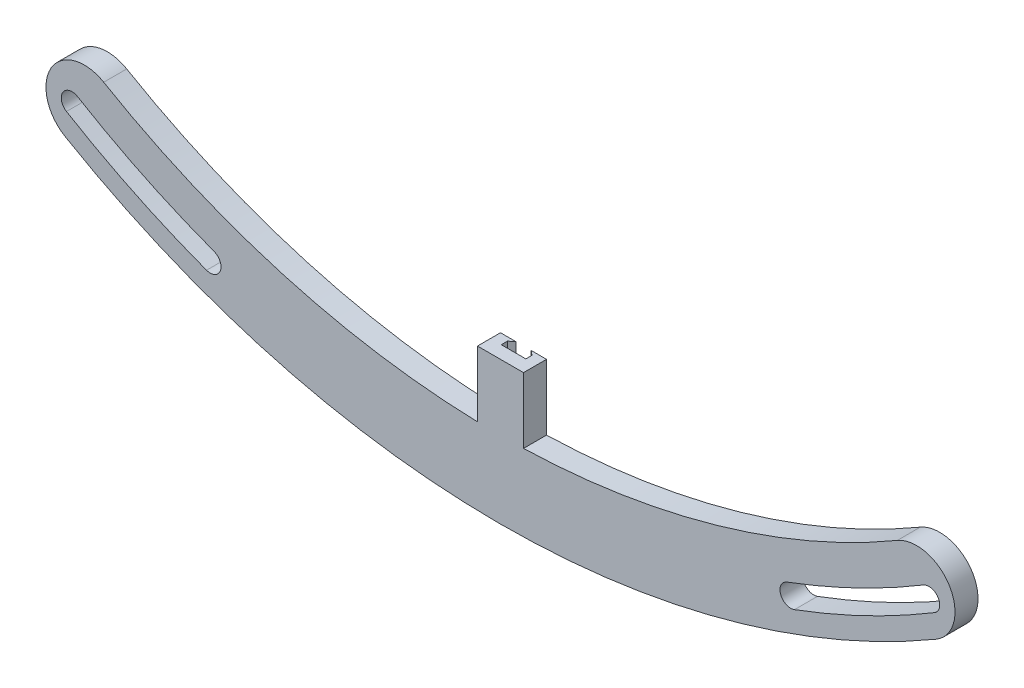
ISO-10303-21;
HEADER;
FILE_DESCRIPTION(('STEP AP214'),'2;1');
FILE_NAME('part.step','',(''),(''),'','','');
FILE_SCHEMA(('AUTOMOTIVE_DESIGN { 1 0 10303 214 1 1 1 1 }'));
ENDSEC;
DATA;
#1=APPLICATION_CONTEXT('core data for automotive mechanical design processes');
#2=APPLICATION_PROTOCOL_DEFINITION('international standard','automotive_design',2000,#1);
#3=PRODUCT_CONTEXT('',#1,'mechanical');
#4=PRODUCT('Part','Part','',(#3));
#5=PRODUCT_RELATED_PRODUCT_CATEGORY('part','',(#4));
#6=PRODUCT_DEFINITION_FORMATION('','',#4);
#7=PRODUCT_DEFINITION_CONTEXT('part definition',#1,'design');
#8=PRODUCT_DEFINITION('design','',#6,#7);
#9=PRODUCT_DEFINITION_SHAPE('','',#8);
#10=(LENGTH_UNIT() NAMED_UNIT(*) SI_UNIT(.MILLI.,.METRE.));
#11=(NAMED_UNIT(*) PLANE_ANGLE_UNIT() SI_UNIT($,.RADIAN.));
#12=(NAMED_UNIT(*) SI_UNIT($,.STERADIAN.) SOLID_ANGLE_UNIT());
#13=UNCERTAINTY_MEASURE_WITH_UNIT(LENGTH_MEASURE(1.E-05),#10,'distance_accuracy_value','');
#14=(GEOMETRIC_REPRESENTATION_CONTEXT(3) GLOBAL_UNCERTAINTY_ASSIGNED_CONTEXT((#13)) GLOBAL_UNIT_ASSIGNED_CONTEXT((#10,
#11,#12)) REPRESENTATION_CONTEXT('',''));
#15=CARTESIAN_POINT('',(0.,0.,0.));
#16=DIRECTION('',(0.,0.,1.));
#17=DIRECTION('',(1.,0.,0.));
#18=AXIS2_PLACEMENT_3D('',#15,#16,#17);
#19=CARTESIAN_POINT('',(0.,0.,0.));
#20=DIRECTION('',(0.,0.,1.));
#21=DIRECTION('',(1.,0.,0.));
#22=AXIS2_PLACEMENT_3D('',#19,#20,#21);
#23=CYLINDRICAL_SURFACE('',#22,130.048);
#24=CARTESIAN_POINT('',(0.,0.,0.));
#25=DIRECTION('',(0.,0.,1.));
#26=DIRECTION('',(1.,0.,0.));
#27=AXIS2_PLACEMENT_3D('',#24,#25,#26);
#28=CIRCLE('',#27,130.048);
#29=CARTESIAN_POINT('',(3.81000000000001,-129.992177472339,0.));
#30=VERTEX_POINT('',#29);
#31=CARTESIAN_POINT('',(65.6747922195251,-112.246621200472,0.));
#32=VERTEX_POINT('',#31);
#33=EDGE_CURVE('E467',#30,#32,#28,.T.);
#34=ORIENTED_EDGE('',*,*,#33,.F.);
#35=DIRECTION('',(0.,0.,1.));
#36=VECTOR('',#35,1.);
#37=CARTESIAN_POINT('',(3.81000000000001,-129.992177472339,0.));
#38=LINE('',#37,#36);
#39=CARTESIAN_POINT('',(3.81,-129.992177472339,3.81));
#40=VERTEX_POINT('',#39);
#41=EDGE_CURVE('E12',#30,#40,#38,.T.);
#42=ORIENTED_EDGE('',*,*,#41,.T.);
#43=CARTESIAN_POINT('',(0.,0.,3.81));
#44=DIRECTION('',(0.,0.,1.));
#45=DIRECTION('',(1.,0.,0.));
#46=AXIS2_PLACEMENT_3D('',#43,#44,#45);
#47=CIRCLE('',#46,130.048);
#48=CARTESIAN_POINT('',(65.6747922195251,-112.246621200472,3.81));
#49=VERTEX_POINT('',#48);
#50=EDGE_CURVE('E471',#40,#49,#47,.T.);
#51=ORIENTED_EDGE('',*,*,#50,.T.);
#52=DIRECTION('',(0.,0.,1.));
#53=VECTOR('',#52,1.);
#54=CARTESIAN_POINT('',(65.6747922195251,-112.246621200472,0.));
#55=LINE('',#54,#53);
#56=EDGE_CURVE('E391',#32,#49,#55,.T.);
#57=ORIENTED_EDGE('',*,*,#56,.F.);
#58=EDGE_LOOP('',(#34,#42,#51,#57));
#59=FACE_BOUND('',#58,.T.);
#60=ADVANCED_FACE('F177',(#59),#23,.F.);
#61=CARTESIAN_POINT('',(0.,142.748,3.81));
#62=DIRECTION('',(0.,0.,-1.));
#63=DIRECTION('',(-1.,0.,0.));
#64=AXIS2_PLACEMENT_3D('',#61,#62,#63);
#65=PLANE('',#64);
#66=DIRECTION('',(0.,-1.,0.));
#67=VECTOR('',#66,1.);
#68=CARTESIAN_POINT('',(-3.80999999999999,-119.126,3.81));
#69=LINE('',#68,#67);
#70=CARTESIAN_POINT('',(-3.80999999999999,-119.126,3.81));
#71=VERTEX_POINT('',#70);
#72=CARTESIAN_POINT('',(-3.80999999999999,-129.992177472339,3.81));
#73=VERTEX_POINT('',#72);
#74=EDGE_CURVE('E375',#71,#73,#69,.T.);
#75=ORIENTED_EDGE('',*,*,#74,.T.);
#76=CARTESIAN_POINT('',(-65.6747922195251,-112.246621200472,3.81));
#77=VERTEX_POINT('',#76);
#78=EDGE_CURVE('E472',#77,#73,#47,.T.);
#79=ORIENTED_EDGE('',*,*,#78,.F.);
#80=CARTESIAN_POINT('',(-68.8815691833698,-117.727413251277,3.81));
#81=DIRECTION('',(0.,0.,1.));
#82=DIRECTION('',(1.,0.,0.));
#83=AXIS2_PLACEMENT_3D('',#80,#81,#82);
#84=CIRCLE('',#83,6.35000000000146);
#85=CARTESIAN_POINT('',(-72.0883461472131,-123.20820530208,3.81));
#86=VERTEX_POINT('',#85);
#87=EDGE_CURVE('E384',#77,#86,#84,.T.);
#88=ORIENTED_EDGE('',*,*,#87,.T.);
#89=CARTESIAN_POINT('',(0.,0.,3.81));
#90=DIRECTION('',(0.,0.,1.));
#91=DIRECTION('',(1.,0.,0.));
#92=AXIS2_PLACEMENT_3D('',#89,#90,#91);
#93=CIRCLE('',#92,142.748);
#94=CARTESIAN_POINT('',(72.0883461472131,-123.20820530208,3.81));
#95=VERTEX_POINT('',#94);
#96=EDGE_CURVE('E460',#86,#95,#93,.T.);
#97=ORIENTED_EDGE('',*,*,#96,.T.);
#98=CARTESIAN_POINT('',(68.8815691833698,-117.727413251277,3.81));
#99=DIRECTION('',(0.,0.,1.));
#100=DIRECTION('',(1.,0.,0.));
#101=AXIS2_PLACEMENT_3D('',#98,#99,#100);
#102=CIRCLE('',#101,6.35000000000147);
#103=EDGE_CURVE('E371',#95,#49,#102,.T.);
#104=ORIENTED_EDGE('',*,*,#103,.T.);
#105=ORIENTED_EDGE('',*,*,#50,.F.);
#106=DIRECTION('',(0.,-1.,0.));
#107=VECTOR('',#106,1.);
#108=CARTESIAN_POINT('',(3.81,-119.126,3.81));
#109=LINE('',#108,#107);
#110=CARTESIAN_POINT('',(3.81,-119.126,3.81));
#111=VERTEX_POINT('',#110);
#112=EDGE_CURVE('E367',#111,#40,#109,.T.);
#113=ORIENTED_EDGE('',*,*,#112,.F.);
#114=DIRECTION('',(-1.,0.,0.));
#115=VECTOR('',#114,1.);
#116=CARTESIAN_POINT('',(3.81,-119.126,3.81));
#117=LINE('',#116,#115);
#118=EDGE_CURVE('E358',#111,#71,#117,.T.);
#119=ORIENTED_EDGE('',*,*,#118,.T.);
#120=EDGE_LOOP('',(#75,#79,#88,#97,#104,#105,#113,#119));
#121=FACE_BOUND('',#120,.T.);
#122=CARTESIAN_POINT('',(-48.0348926952969,-129.015996325072,3.81));
#123=DIRECTION('',(0.,0.,1.));
#124=DIRECTION('',(1.,0.,0.));
#125=AXIS2_PLACEMENT_3D('',#122,#123,#124);
#126=CIRCLE('',#125,1.77800000000003);
#127=CARTESIAN_POINT('',(-48.6552695382252,-130.682254580193,3.81));
#128=VERTEX_POINT('',#127);
#129=CARTESIAN_POINT('',(-47.4145158523687,-127.349738069951,3.81));
#130=VERTEX_POINT('',#129);
#131=EDGE_CURVE('E438',#128,#130,#126,.T.);
#132=ORIENTED_EDGE('',*,*,#131,.F.);
#133=CARTESIAN_POINT('',(0.,0.,3.81));
#134=DIRECTION('',(0.,0.,1.));
#135=DIRECTION('',(1.,0.,0.));
#136=AXIS2_PLACEMENT_3D('',#133,#134,#135);
#137=CIRCLE('',#136,139.445999999999);
#138=CARTESIAN_POINT('',(-71.8354364669194,-119.519274527613,3.81));
#139=VERTEX_POINT('',#138);
#140=EDGE_CURVE('E447',#139,#128,#137,.T.);
#141=ORIENTED_EDGE('',*,*,#140,.F.);
#142=CARTESIAN_POINT('',(-70.9195019400187,-117.995349351487,3.81));
#143=DIRECTION('',(0.,0.,1.));
#144=DIRECTION('',(1.,0.,0.));
#145=AXIS2_PLACEMENT_3D('',#142,#143,#144);
#146=CIRCLE('',#145,1.77800000000006);
#147=CARTESIAN_POINT('',(-70.0035674131181,-116.471424175361,3.81));
#148=VERTEX_POINT('',#147);
#149=EDGE_CURVE('E454',#148,#139,#146,.T.);
#150=ORIENTED_EDGE('',*,*,#149,.F.);
#151=CARTESIAN_POINT('',(0.,0.,3.81));
#152=DIRECTION('',(0.,0.,1.));
#153=DIRECTION('',(1.,0.,0.));
#154=AXIS2_PLACEMENT_3D('',#151,#152,#153);
#155=CIRCLE('',#154,135.889999999999);
#156=EDGE_CURVE('E441',#148,#130,#155,.T.);
#157=ORIENTED_EDGE('',*,*,#156,.T.);
#158=EDGE_LOOP('',(#132,#141,#150,#157));
#159=FACE_BOUND('',#158,.T.);
#160=CARTESIAN_POINT('',(70.9195019400257,-117.995349351485,3.81));
#161=DIRECTION('',(0.,0.,1.));
#162=DIRECTION('',(1.,0.,0.));
#163=AXIS2_PLACEMENT_3D('',#160,#161,#162);
#164=CIRCLE('',#163,1.77800000000003);
#165=CARTESIAN_POINT('',(71.8354364669264,-119.519274527611,3.81));
#166=VERTEX_POINT('',#165);
#167=CARTESIAN_POINT('',(70.003567413125,-116.471424175358,3.81));
#168=VERTEX_POINT('',#167);
#169=EDGE_CURVE('E408',#166,#168,#164,.T.);
#170=ORIENTED_EDGE('',*,*,#169,.F.);
#171=CARTESIAN_POINT('',(0.,0.,3.81));
#172=DIRECTION('',(0.,0.,1.));
#173=DIRECTION('',(1.,0.,0.));
#174=AXIS2_PLACEMENT_3D('',#171,#172,#173);
#175=CIRCLE('',#174,139.446000000001);
#176=CARTESIAN_POINT('',(48.6552695382329,-130.682254580192,3.81));
#177=VERTEX_POINT('',#176);
#178=EDGE_CURVE('E417',#177,#166,#175,.T.);
#179=ORIENTED_EDGE('',*,*,#178,.F.);
#180=CARTESIAN_POINT('',(48.0348926953046,-129.015996325071,3.81));
#181=DIRECTION('',(0.,0.,1.));
#182=DIRECTION('',(1.,0.,0.));
#183=AXIS2_PLACEMENT_3D('',#180,#181,#182);
#184=CIRCLE('',#183,1.77800000000002);
#185=CARTESIAN_POINT('',(47.4145158523763,-127.34973806995,3.81));
#186=VERTEX_POINT('',#185);
#187=EDGE_CURVE('E424',#186,#177,#184,.T.);
#188=ORIENTED_EDGE('',*,*,#187,.F.);
#189=CARTESIAN_POINT('',(0.,0.,3.81));
#190=DIRECTION('',(0.,0.,1.));
#191=DIRECTION('',(1.,0.,0.));
#192=AXIS2_PLACEMENT_3D('',#189,#190,#191);
#193=CIRCLE('',#192,135.890000000001);
#194=EDGE_CURVE('E411',#186,#168,#193,.T.);
#195=ORIENTED_EDGE('',*,*,#194,.T.);
#196=EDGE_LOOP('',(#170,#179,#188,#195));
#197=FACE_BOUND('',#196,.T.);
#198=ADVANCED_FACE('F179',(#121,#159,#197),#65,.F.);
#199=CARTESIAN_POINT('',(0.,130.048,0.));
#200=DIRECTION('',(0.,0.,1.));
#201=DIRECTION('',(1.,0.,0.));
#202=AXIS2_PLACEMENT_3D('',#199,#200,#201);
#203=PLANE('',#202);
#204=DIRECTION('',(-1.,0.,0.));
#205=VECTOR('',#204,1.);
#206=CARTESIAN_POINT('',(1.27,-125.222,0.));
#207=LINE('',#206,#205);
#208=CARTESIAN_POINT('',(1.27,-125.222,0.));
#209=VERTEX_POINT('',#208);
#210=CARTESIAN_POINT('',(-1.27,-125.222,0.));
#211=VERTEX_POINT('',#210);
#212=EDGE_CURVE('E331',#209,#211,#207,.T.);
#213=ORIENTED_EDGE('',*,*,#212,.F.);
#214=DIRECTION('',(0.,1.,0.));
#215=VECTOR('',#214,1.);
#216=CARTESIAN_POINT('',(1.27,-125.222,0.));
#217=LINE('',#216,#215);
#218=CARTESIAN_POINT('',(1.27,-119.126,0.));
#219=VERTEX_POINT('',#218);
#220=EDGE_CURVE('E359',#209,#219,#217,.T.);
#221=ORIENTED_EDGE('',*,*,#220,.T.);
#222=DIRECTION('',(1.,0.,0.));
#223=VECTOR('',#222,1.);
#224=CARTESIAN_POINT('',(3.81000000000001,-119.126,0.));
#225=LINE('',#224,#223);
#226=CARTESIAN_POINT('',(3.81000000000001,-119.126,0.));
#227=VERTEX_POINT('',#226);
#228=EDGE_CURVE('E365',#219,#227,#225,.T.);
#229=ORIENTED_EDGE('',*,*,#228,.T.);
#230=DIRECTION('',(0.,-1.,0.));
#231=VECTOR('',#230,1.);
#232=CARTESIAN_POINT('',(3.81000000000001,-119.126,0.));
#233=LINE('',#232,#231);
#234=EDGE_CURVE('E368',#227,#30,#233,.T.);
#235=ORIENTED_EDGE('',*,*,#234,.T.);
#236=ORIENTED_EDGE('',*,*,#33,.T.);
#237=CARTESIAN_POINT('',(68.8815691833698,-117.727413251277,0.));
#238=DIRECTION('',(0.,0.,1.));
#239=DIRECTION('',(1.,0.,0.));
#240=AXIS2_PLACEMENT_3D('',#237,#238,#239);
#241=CIRCLE('',#240,6.35000000000147);
#242=CARTESIAN_POINT('',(72.0883461472131,-123.20820530208,0.));
#243=VERTEX_POINT('',#242);
#244=EDGE_CURVE('E380',#243,#32,#241,.T.);
#245=ORIENTED_EDGE('',*,*,#244,.F.);
#246=CARTESIAN_POINT('',(0.,0.,0.));
#247=DIRECTION('',(0.,0.,1.));
#248=DIRECTION('',(1.,0.,0.));
#249=AXIS2_PLACEMENT_3D('',#246,#247,#248);
#250=CIRCLE('',#249,142.748);
#251=CARTESIAN_POINT('',(-72.088346147213,-123.20820530208,0.));
#252=VERTEX_POINT('',#251);
#253=EDGE_CURVE('E464',#252,#243,#250,.T.);
#254=ORIENTED_EDGE('',*,*,#253,.F.);
#255=CARTESIAN_POINT('',(-68.8815691833698,-117.727413251277,0.));
#256=DIRECTION('',(0.,0.,1.));
#257=DIRECTION('',(1.,0.,0.));
#258=AXIS2_PLACEMENT_3D('',#255,#256,#257);
#259=CIRCLE('',#258,6.35000000000146);
#260=CARTESIAN_POINT('',(-65.6747922195251,-112.246621200472,0.));
#261=VERTEX_POINT('',#260);
#262=EDGE_CURVE('E383',#261,#252,#259,.T.);
#263=ORIENTED_EDGE('',*,*,#262,.F.);
#264=CARTESIAN_POINT('',(-3.80999999999999,-129.992177472339,0.));
#265=VERTEX_POINT('',#264);
#266=EDGE_CURVE('E468',#261,#265,#28,.T.);
#267=ORIENTED_EDGE('',*,*,#266,.T.);
#268=DIRECTION('',(0.,-1.,0.));
#269=VECTOR('',#268,1.);
#270=CARTESIAN_POINT('',(-3.80999999999999,-119.126,0.));
#271=LINE('',#270,#269);
#272=CARTESIAN_POINT('',(-3.80999999999999,-119.126,0.));
#273=VERTEX_POINT('',#272);
#274=EDGE_CURVE('E372',#273,#265,#271,.T.);
#275=ORIENTED_EDGE('',*,*,#274,.F.);
#276=CARTESIAN_POINT('',(-1.27,-119.126,0.));
#277=VERTEX_POINT('',#276);
#278=EDGE_CURVE('E347',#273,#277,#225,.T.);
#279=ORIENTED_EDGE('',*,*,#278,.T.);
#280=DIRECTION('',(0.,1.,0.));
#281=VECTOR('',#280,1.);
#282=CARTESIAN_POINT('',(-1.27,-125.222,0.));
#283=LINE('',#282,#281);
#284=EDGE_CURVE('E192',#211,#277,#283,.T.);
#285=ORIENTED_EDGE('',*,*,#284,.F.);
#286=EDGE_LOOP('',(#213,#221,#229,#235,#236,#245,#254,#263,#267,#275,#279,#285));
#287=FACE_BOUND('',#286,.T.);
#288=CARTESIAN_POINT('',(0.,0.,0.));
#289=DIRECTION('',(0.,0.,1.));
#290=DIRECTION('',(1.,0.,0.));
#291=AXIS2_PLACEMENT_3D('',#288,#289,#290);
#292=CIRCLE('',#291,139.446000000001);
#293=CARTESIAN_POINT('',(48.6552695382329,-130.682254580192,0.));
#294=VERTEX_POINT('',#293);
#295=CARTESIAN_POINT('',(71.8354364669264,-119.519274527611,0.));
#296=VERTEX_POINT('',#295);
#297=EDGE_CURVE('E420',#294,#296,#292,.T.);
#298=ORIENTED_EDGE('',*,*,#297,.T.);
#299=CARTESIAN_POINT('',(70.9195019400257,-117.995349351485,0.));
#300=DIRECTION('',(0.,0.,1.));
#301=DIRECTION('',(1.,0.,0.));
#302=AXIS2_PLACEMENT_3D('',#299,#300,#301);
#303=CIRCLE('',#302,1.77800000000003);
#304=CARTESIAN_POINT('',(70.003567413125,-116.471424175358,0.));
#305=VERTEX_POINT('',#304);
#306=EDGE_CURVE('E404',#296,#305,#303,.T.);
#307=ORIENTED_EDGE('',*,*,#306,.T.);
#308=CARTESIAN_POINT('',(0.,0.,0.));
#309=DIRECTION('',(0.,0.,1.));
#310=DIRECTION('',(1.,0.,0.));
#311=AXIS2_PLACEMENT_3D('',#308,#309,#310);
#312=CIRCLE('',#311,135.890000000001);
#313=CARTESIAN_POINT('',(47.4145158523763,-127.34973806995,0.));
#314=VERTEX_POINT('',#313);
#315=EDGE_CURVE('E414',#314,#305,#312,.T.);
#316=ORIENTED_EDGE('',*,*,#315,.F.);
#317=CARTESIAN_POINT('',(48.0348926953046,-129.015996325071,0.));
#318=DIRECTION('',(0.,0.,1.));
#319=DIRECTION('',(1.,0.,0.));
#320=AXIS2_PLACEMENT_3D('',#317,#318,#319);
#321=CIRCLE('',#320,1.77800000000002);
#322=EDGE_CURVE('E416',#314,#294,#321,.T.);
#323=ORIENTED_EDGE('',*,*,#322,.T.);
#324=EDGE_LOOP('',(#298,#307,#316,#323));
#325=FACE_BOUND('',#324,.T.);
#326=CARTESIAN_POINT('',(0.,0.,0.));
#327=DIRECTION('',(0.,0.,1.));
#328=DIRECTION('',(1.,0.,0.));
#329=AXIS2_PLACEMENT_3D('',#326,#327,#328);
#330=CIRCLE('',#329,139.445999999999);
#331=CARTESIAN_POINT('',(-71.8354364669194,-119.519274527613,0.));
#332=VERTEX_POINT('',#331);
#333=CARTESIAN_POINT('',(-48.6552695382252,-130.682254580193,0.));
#334=VERTEX_POINT('',#333);
#335=EDGE_CURVE('E450',#332,#334,#330,.T.);
#336=ORIENTED_EDGE('',*,*,#335,.T.);
#337=CARTESIAN_POINT('',(-48.0348926952969,-129.015996325072,0.));
#338=DIRECTION('',(0.,0.,1.));
#339=DIRECTION('',(1.,0.,0.));
#340=AXIS2_PLACEMENT_3D('',#337,#338,#339);
#341=CIRCLE('',#340,1.77800000000003);
#342=CARTESIAN_POINT('',(-47.4145158523687,-127.349738069951,0.));
#343=VERTEX_POINT('',#342);
#344=EDGE_CURVE('E434',#334,#343,#341,.T.);
#345=ORIENTED_EDGE('',*,*,#344,.T.);
#346=CARTESIAN_POINT('',(0.,0.,0.));
#347=DIRECTION('',(0.,0.,1.));
#348=DIRECTION('',(1.,0.,0.));
#349=AXIS2_PLACEMENT_3D('',#346,#347,#348);
#350=CIRCLE('',#349,135.889999999999);
#351=CARTESIAN_POINT('',(-70.0035674131181,-116.471424175361,0.));
#352=VERTEX_POINT('',#351);
#353=EDGE_CURVE('E444',#352,#343,#350,.T.);
#354=ORIENTED_EDGE('',*,*,#353,.F.);
#355=CARTESIAN_POINT('',(-70.9195019400187,-117.995349351487,0.));
#356=DIRECTION('',(0.,0.,1.));
#357=DIRECTION('',(1.,0.,0.));
#358=AXIS2_PLACEMENT_3D('',#355,#356,#357);
#359=CIRCLE('',#358,1.77800000000006);
#360=EDGE_CURVE('E446',#352,#332,#359,.T.);
#361=ORIENTED_EDGE('',*,*,#360,.T.);
#362=EDGE_LOOP('',(#336,#345,#354,#361));
#363=FACE_BOUND('',#362,.T.);
#364=ADVANCED_FACE('F344',(#287,#325,#363),#203,.F.);
#365=ORIENTED_EDGE('',*,*,#78,.T.);
#366=DIRECTION('',(0.,0.,1.));
#367=VECTOR('',#366,1.);
#368=CARTESIAN_POINT('',(-3.80999999999999,-129.992177472339,0.));
#369=LINE('',#368,#367);
#370=EDGE_CURVE('E185',#73,#265,#369,.F.);
#371=ORIENTED_EDGE('',*,*,#370,.T.);
#372=ORIENTED_EDGE('',*,*,#266,.F.);
#373=DIRECTION('',(0.,0.,1.));
#374=VECTOR('',#373,1.);
#375=CARTESIAN_POINT('',(-65.6747922195251,-112.246621200472,0.));
#376=LINE('',#375,#374);
#377=EDGE_CURVE('E395',#261,#77,#376,.T.);
#378=ORIENTED_EDGE('',*,*,#377,.T.);
#379=EDGE_LOOP('',(#365,#371,#372,#378));
#380=FACE_BOUND('',#379,.T.);
#381=ADVANCED_FACE('F476',(#380),#23,.F.);
#382=CARTESIAN_POINT('',(0.,0.,0.));
#383=DIRECTION('',(0.,0.,1.));
#384=DIRECTION('',(1.,0.,0.));
#385=AXIS2_PLACEMENT_3D('',#382,#383,#384);
#386=CYLINDRICAL_SURFACE('',#385,142.748);
#387=ORIENTED_EDGE('',*,*,#253,.T.);
#388=DIRECTION('',(0.,0.,1.));
#389=VECTOR('',#388,1.);
#390=CARTESIAN_POINT('',(72.0883461472131,-123.20820530208,0.));
#391=LINE('',#390,#389);
#392=EDGE_CURVE('E386',#243,#95,#391,.T.);
#393=ORIENTED_EDGE('',*,*,#392,.T.);
#394=ORIENTED_EDGE('',*,*,#96,.F.);
#395=DIRECTION('',(0.,0.,1.));
#396=VECTOR('',#395,1.);
#397=CARTESIAN_POINT('',(-72.0883461472131,-123.20820530208,0.));
#398=LINE('',#397,#396);
#399=EDGE_CURVE('E398',#252,#86,#398,.T.);
#400=ORIENTED_EDGE('',*,*,#399,.F.);
#401=EDGE_LOOP('',(#387,#393,#394,#400));
#402=FACE_BOUND('',#401,.T.);
#403=ADVANCED_FACE('F535',(#402),#386,.T.);
#404=CARTESIAN_POINT('',(0.,0.,0.));
#405=DIRECTION('',(0.,0.,1.));
#406=DIRECTION('',(1.,0.,0.));
#407=AXIS2_PLACEMENT_3D('',#404,#405,#406);
#408=CYLINDRICAL_SURFACE('',#407,135.889999999999);
#409=ORIENTED_EDGE('',*,*,#156,.F.);
#410=DIRECTION('',(0.,0.,1.));
#411=VECTOR('',#410,1.);
#412=CARTESIAN_POINT('',(-70.0035674131181,-116.471424175361,0.));
#413=LINE('',#412,#411);
#414=EDGE_CURVE('E452',#352,#148,#413,.T.);
#415=ORIENTED_EDGE('',*,*,#414,.F.);
#416=ORIENTED_EDGE('',*,*,#353,.T.);
#417=DIRECTION('',(0.,0.,1.));
#418=VECTOR('',#417,1.);
#419=CARTESIAN_POINT('',(-47.4145158523687,-127.349738069951,0.));
#420=LINE('',#419,#418);
#421=EDGE_CURVE('E435',#343,#130,#420,.T.);
#422=ORIENTED_EDGE('',*,*,#421,.T.);
#423=EDGE_LOOP('',(#409,#415,#416,#422));
#424=FACE_BOUND('',#423,.T.);
#425=ADVANCED_FACE('F561',(#424),#408,.T.);
#426=CARTESIAN_POINT('',(0.,0.,0.));
#427=DIRECTION('',(0.,0.,1.));
#428=DIRECTION('',(1.,0.,0.));
#429=AXIS2_PLACEMENT_3D('',#426,#427,#428);
#430=CYLINDRICAL_SURFACE('',#429,139.445999999999);
#431=ORIENTED_EDGE('',*,*,#140,.T.);
#432=DIRECTION('',(0.,0.,1.));
#433=VECTOR('',#432,1.);
#434=CARTESIAN_POINT('',(-48.6552695382252,-130.682254580193,0.));
#435=LINE('',#434,#433);
#436=EDGE_CURVE('E430',#334,#128,#435,.T.);
#437=ORIENTED_EDGE('',*,*,#436,.F.);
#438=ORIENTED_EDGE('',*,*,#335,.F.);
#439=DIRECTION('',(0.,0.,1.));
#440=VECTOR('',#439,1.);
#441=CARTESIAN_POINT('',(-71.8354364669194,-119.519274527613,0.));
#442=LINE('',#441,#440);
#443=EDGE_CURVE('E458',#332,#139,#442,.T.);
#444=ORIENTED_EDGE('',*,*,#443,.T.);
#445=EDGE_LOOP('',(#431,#437,#438,#444));
#446=FACE_BOUND('',#445,.T.);
#447=ADVANCED_FACE('F568',(#446),#430,.F.);
#448=CARTESIAN_POINT('',(-70.9195019400187,-117.995349351487,0.));
#449=DIRECTION('',(0.,0.,1.));
#450=DIRECTION('',(1.,0.,0.));
#451=AXIS2_PLACEMENT_3D('',#448,#449,#450);
#452=CYLINDRICAL_SURFACE('',#451,1.77800000000006);
#453=ORIENTED_EDGE('',*,*,#149,.T.);
#454=ORIENTED_EDGE('',*,*,#443,.F.);
#455=ORIENTED_EDGE('',*,*,#360,.F.);
#456=ORIENTED_EDGE('',*,*,#414,.T.);
#457=EDGE_LOOP('',(#453,#454,#455,#456));
#458=FACE_BOUND('',#457,.T.);
#459=ADVANCED_FACE('F570',(#458),#452,.F.);
#460=CARTESIAN_POINT('',(-48.0348926952969,-129.015996325072,0.));
#461=DIRECTION('',(0.,0.,1.));
#462=DIRECTION('',(1.,0.,0.));
#463=AXIS2_PLACEMENT_3D('',#460,#461,#462);
#464=CYLINDRICAL_SURFACE('',#463,1.77800000000003);
#465=ORIENTED_EDGE('',*,*,#131,.T.);
#466=ORIENTED_EDGE('',*,*,#421,.F.);
#467=ORIENTED_EDGE('',*,*,#344,.F.);
#468=ORIENTED_EDGE('',*,*,#436,.T.);
#469=EDGE_LOOP('',(#465,#466,#467,#468));
#470=FACE_BOUND('',#469,.T.);
#471=ADVANCED_FACE('F573',(#470),#464,.F.);
#472=CARTESIAN_POINT('',(0.,0.,0.));
#473=DIRECTION('',(0.,0.,1.));
#474=DIRECTION('',(1.,0.,0.));
#475=AXIS2_PLACEMENT_3D('',#472,#473,#474);
#476=CYLINDRICAL_SURFACE('',#475,135.890000000001);
#477=ORIENTED_EDGE('',*,*,#194,.F.);
#478=DIRECTION('',(0.,0.,1.));
#479=VECTOR('',#478,1.);
#480=CARTESIAN_POINT('',(47.4145158523763,-127.34973806995,0.));
#481=LINE('',#480,#479);
#482=EDGE_CURVE('E422',#314,#186,#481,.T.);
#483=ORIENTED_EDGE('',*,*,#482,.F.);
#484=ORIENTED_EDGE('',*,*,#315,.T.);
#485=DIRECTION('',(0.,0.,1.));
#486=VECTOR('',#485,1.);
#487=CARTESIAN_POINT('',(70.003567413125,-116.471424175358,0.));
#488=LINE('',#487,#486);
#489=EDGE_CURVE('E405',#305,#168,#488,.T.);
#490=ORIENTED_EDGE('',*,*,#489,.T.);
#491=EDGE_LOOP('',(#477,#483,#484,#490));
#492=FACE_BOUND('',#491,.T.);
#493=ADVANCED_FACE('F580',(#492),#476,.T.);
#494=CARTESIAN_POINT('',(0.,0.,0.));
#495=DIRECTION('',(0.,0.,1.));
#496=DIRECTION('',(1.,0.,0.));
#497=AXIS2_PLACEMENT_3D('',#494,#495,#496);
#498=CYLINDRICAL_SURFACE('',#497,139.446000000001);
#499=ORIENTED_EDGE('',*,*,#178,.T.);
#500=DIRECTION('',(0.,0.,1.));
#501=VECTOR('',#500,1.);
#502=CARTESIAN_POINT('',(71.8354364669264,-119.519274527611,0.));
#503=LINE('',#502,#501);
#504=EDGE_CURVE('E394',#296,#166,#503,.T.);
#505=ORIENTED_EDGE('',*,*,#504,.F.);
#506=ORIENTED_EDGE('',*,*,#297,.F.);
#507=DIRECTION('',(0.,0.,1.));
#508=VECTOR('',#507,1.);
#509=CARTESIAN_POINT('',(48.6552695382329,-130.682254580192,0.));
#510=LINE('',#509,#508);
#511=EDGE_CURVE('E428',#294,#177,#510,.T.);
#512=ORIENTED_EDGE('',*,*,#511,.T.);
#513=EDGE_LOOP('',(#499,#505,#506,#512));
#514=FACE_BOUND('',#513,.T.);
#515=ADVANCED_FACE('F584',(#514),#498,.F.);
#516=CARTESIAN_POINT('',(48.0348926953046,-129.015996325071,0.));
#517=DIRECTION('',(0.,0.,1.));
#518=DIRECTION('',(1.,0.,0.));
#519=AXIS2_PLACEMENT_3D('',#516,#517,#518);
#520=CYLINDRICAL_SURFACE('',#519,1.77800000000002);
#521=ORIENTED_EDGE('',*,*,#187,.T.);
#522=ORIENTED_EDGE('',*,*,#511,.F.);
#523=ORIENTED_EDGE('',*,*,#322,.F.);
#524=ORIENTED_EDGE('',*,*,#482,.T.);
#525=EDGE_LOOP('',(#521,#522,#523,#524));
#526=FACE_BOUND('',#525,.T.);
#527=ADVANCED_FACE('F547',(#526),#520,.F.);
#528=CARTESIAN_POINT('',(70.9195019400257,-117.995349351485,0.));
#529=DIRECTION('',(0.,0.,1.));
#530=DIRECTION('',(1.,0.,0.));
#531=AXIS2_PLACEMENT_3D('',#528,#529,#530);
#532=CYLINDRICAL_SURFACE('',#531,1.77800000000003);
#533=ORIENTED_EDGE('',*,*,#169,.T.);
#534=ORIENTED_EDGE('',*,*,#489,.F.);
#535=ORIENTED_EDGE('',*,*,#306,.F.);
#536=ORIENTED_EDGE('',*,*,#504,.T.);
#537=EDGE_LOOP('',(#533,#534,#535,#536));
#538=FACE_BOUND('',#537,.T.);
#539=ADVANCED_FACE('F540',(#538),#532,.F.);
#540=CARTESIAN_POINT('',(-68.8815691833698,-117.727413251277,0.));
#541=DIRECTION('',(0.,0.,1.));
#542=DIRECTION('',(1.,0.,0.));
#543=AXIS2_PLACEMENT_3D('',#540,#541,#542);
#544=CYLINDRICAL_SURFACE('',#543,6.35000000000146);
#545=ORIENTED_EDGE('',*,*,#87,.F.);
#546=ORIENTED_EDGE('',*,*,#377,.F.);
#547=ORIENTED_EDGE('',*,*,#262,.T.);
#548=ORIENTED_EDGE('',*,*,#399,.T.);
#549=EDGE_LOOP('',(#545,#546,#547,#548));
#550=FACE_BOUND('',#549,.T.);
#551=ADVANCED_FACE('F538',(#550),#544,.T.);
#552=CARTESIAN_POINT('',(68.8815691833698,-117.727413251277,0.));
#553=DIRECTION('',(0.,0.,1.));
#554=DIRECTION('',(1.,0.,0.));
#555=AXIS2_PLACEMENT_3D('',#552,#553,#554);
#556=CYLINDRICAL_SURFACE('',#555,6.35000000000147);
#557=ORIENTED_EDGE('',*,*,#103,.F.);
#558=ORIENTED_EDGE('',*,*,#392,.F.);
#559=ORIENTED_EDGE('',*,*,#244,.T.);
#560=ORIENTED_EDGE('',*,*,#56,.T.);
#561=EDGE_LOOP('',(#557,#558,#559,#560));
#562=FACE_BOUND('',#561,.T.);
#563=ADVANCED_FACE('F530',(#562),#556,.T.);
#564=CARTESIAN_POINT('',(3.81000000000001,-119.126,0.));
#565=DIRECTION('',(1.,0.,0.));
#566=DIRECTION('',(0.,0.,-1.));
#567=AXIS2_PLACEMENT_3D('',#564,#565,#566);
#568=PLANE('',#567);
#569=ORIENTED_EDGE('',*,*,#41,.F.);
#570=ORIENTED_EDGE('',*,*,#234,.F.);
#571=DIRECTION('',(0.,0.,1.));
#572=VECTOR('',#571,1.);
#573=CARTESIAN_POINT('',(3.81000000000001,-119.126,0.));
#574=LINE('',#573,#572);
#575=EDGE_CURVE('E355',#227,#111,#574,.T.);
#576=ORIENTED_EDGE('',*,*,#575,.T.);
#577=ORIENTED_EDGE('',*,*,#112,.T.);
#578=EDGE_LOOP('',(#569,#570,#576,#577));
#579=FACE_BOUND('',#578,.T.);
#580=ADVANCED_FACE('F526',(#579),#568,.T.);
#581=CARTESIAN_POINT('',(-3.80999999999999,-119.126,0.));
#582=DIRECTION('',(-1.,0.,0.));
#583=DIRECTION('',(0.,0.,1.));
#584=AXIS2_PLACEMENT_3D('',#581,#582,#583);
#585=PLANE('',#584);
#586=ORIENTED_EDGE('',*,*,#370,.F.);
#587=ORIENTED_EDGE('',*,*,#74,.F.);
#588=DIRECTION('',(0.,0.,-1.));
#589=VECTOR('',#588,1.);
#590=CARTESIAN_POINT('',(-3.80999999999999,-119.126,0.));
#591=LINE('',#590,#589);
#592=EDGE_CURVE('E362',#71,#273,#591,.T.);
#593=ORIENTED_EDGE('',*,*,#592,.T.);
#594=ORIENTED_EDGE('',*,*,#274,.T.);
#595=EDGE_LOOP('',(#586,#587,#593,#594));
#596=FACE_BOUND('',#595,.T.);
#597=ADVANCED_FACE('F481',(#596),#585,.T.);
#598=CARTESIAN_POINT('',(3.81,-119.126,3.81));
#599=DIRECTION('',(0.,-1.,0.));
#600=DIRECTION('',(0.,0.,-1.));
#601=AXIS2_PLACEMENT_3D('',#598,#599,#600);
#602=PLANE('',#601);
#603=ORIENTED_EDGE('',*,*,#228,.F.);
#604=DIRECTION('',(-0.768221279597375,0.,-0.64018439966448));
#605=VECTOR('',#604,1.);
#606=CARTESIAN_POINT('',(2.032,-119.126,0.634999999999999));
#607=LINE('',#606,#605);
#608=CARTESIAN_POINT('',(2.032,-119.126,0.634999999999999));
#609=VERTEX_POINT('',#608);
#610=EDGE_CURVE('E341',#609,#219,#607,.T.);
#611=ORIENTED_EDGE('',*,*,#610,.F.);
#612=DIRECTION('',(0.,0.,-1.));
#613=VECTOR('',#612,1.);
#614=CARTESIAN_POINT('',(2.032,-119.126,1.651));
#615=LINE('',#614,#613);
#616=CARTESIAN_POINT('',(2.032,-119.126,1.651));
#617=VERTEX_POINT('',#616);
#618=EDGE_CURVE('E499',#617,#609,#615,.T.);
#619=ORIENTED_EDGE('',*,*,#618,.F.);
#620=DIRECTION('',(1.,0.,0.));
#621=VECTOR('',#620,1.);
#622=CARTESIAN_POINT('',(-2.032,-119.126,1.651));
#623=LINE('',#622,#621);
#624=CARTESIAN_POINT('',(-2.032,-119.126,1.651));
#625=VERTEX_POINT('',#624);
#626=EDGE_CURVE('E493',#625,#617,#623,.T.);
#627=ORIENTED_EDGE('',*,*,#626,.F.);
#628=DIRECTION('',(0.,0.,1.));
#629=VECTOR('',#628,1.);
#630=CARTESIAN_POINT('',(-2.032,-119.126,0.634999999999999));
#631=LINE('',#630,#629);
#632=CARTESIAN_POINT('',(-2.032,-119.126,0.634999999999999));
#633=VERTEX_POINT('',#632);
#634=EDGE_CURVE('E491',#633,#625,#631,.T.);
#635=ORIENTED_EDGE('',*,*,#634,.F.);
#636=DIRECTION('',(-0.768221279597376,0.,0.64018439966448));
#637=VECTOR('',#636,1.);
#638=CARTESIAN_POINT('',(-1.27,-119.126,0.));
#639=LINE('',#638,#637);
#640=EDGE_CURVE('E488',#277,#633,#639,.T.);
#641=ORIENTED_EDGE('',*,*,#640,.F.);
#642=ORIENTED_EDGE('',*,*,#278,.F.);
#643=ORIENTED_EDGE('',*,*,#592,.F.);
#644=ORIENTED_EDGE('',*,*,#118,.F.);
#645=ORIENTED_EDGE('',*,*,#575,.F.);
#646=EDGE_LOOP('',(#603,#611,#619,#627,#635,#641,#642,#643,#644,#645));
#647=FACE_BOUND('',#646,.T.);
#648=ADVANCED_FACE('F486',(#647),#602,.F.);
#649=CARTESIAN_POINT('',(2.032,-125.222,0.634999999999999));
#650=DIRECTION('',(0.64018439966448,0.,-0.768221279597375));
#651=DIRECTION('',(-0.768221279597376,0.,-0.64018439966448));
#652=AXIS2_PLACEMENT_3D('',#649,#650,#651);
#653=PLANE('',#652);
#654=ORIENTED_EDGE('',*,*,#610,.T.);
#655=ORIENTED_EDGE('',*,*,#220,.F.);
#656=DIRECTION('',(-0.768221279597375,0.,-0.64018439966448));
#657=VECTOR('',#656,1.);
#658=CARTESIAN_POINT('',(2.032,-125.222,0.634999999999999));
#659=LINE('',#658,#657);
#660=CARTESIAN_POINT('',(2.032,-125.222,0.634999999999999));
#661=VERTEX_POINT('',#660);
#662=EDGE_CURVE('E338',#661,#209,#659,.T.);
#663=ORIENTED_EDGE('',*,*,#662,.F.);
#664=DIRECTION('',(0.,1.,0.));
#665=VECTOR('',#664,1.);
#666=CARTESIAN_POINT('',(2.032,-125.222,0.634999999999999));
#667=LINE('',#666,#665);
#668=EDGE_CURVE('E504',#661,#609,#667,.T.);
#669=ORIENTED_EDGE('',*,*,#668,.T.);
#670=EDGE_LOOP('',(#654,#655,#663,#669));
#671=FACE_BOUND('',#670,.T.);
#672=ADVANCED_FACE('F522',(#671),#653,.F.);
#673=CARTESIAN_POINT('',(2.032,-125.222,1.651));
#674=DIRECTION('',(1.,0.,0.));
#675=DIRECTION('',(0.,0.,-1.));
#676=AXIS2_PLACEMENT_3D('',#673,#674,#675);
#677=PLANE('',#676);
#678=ORIENTED_EDGE('',*,*,#618,.T.);
#679=ORIENTED_EDGE('',*,*,#668,.F.);
#680=DIRECTION('',(0.,0.,-1.));
#681=VECTOR('',#680,1.);
#682=CARTESIAN_POINT('',(2.032,-125.222,1.651));
#683=LINE('',#682,#681);
#684=CARTESIAN_POINT('',(2.032,-125.222,1.651));
#685=VERTEX_POINT('',#684);
#686=EDGE_CURVE('E351',#685,#661,#683,.T.);
#687=ORIENTED_EDGE('',*,*,#686,.F.);
#688=DIRECTION('',(0.,1.,0.));
#689=VECTOR('',#688,1.);
#690=CARTESIAN_POINT('',(2.032,-125.222,1.651));
#691=LINE('',#690,#689);
#692=EDGE_CURVE('E506',#685,#617,#691,.T.);
#693=ORIENTED_EDGE('',*,*,#692,.T.);
#694=EDGE_LOOP('',(#678,#679,#687,#693));
#695=FACE_BOUND('',#694,.T.);
#696=ADVANCED_FACE('F517',(#695),#677,.F.);
#697=CARTESIAN_POINT('',(-2.032,-125.222,1.651));
#698=DIRECTION('',(0.,0.,1.));
#699=DIRECTION('',(1.,0.,0.));
#700=AXIS2_PLACEMENT_3D('',#697,#698,#699);
#701=PLANE('',#700);
#702=ORIENTED_EDGE('',*,*,#626,.T.);
#703=ORIENTED_EDGE('',*,*,#692,.F.);
#704=DIRECTION('',(1.,0.,0.));
#705=VECTOR('',#704,1.);
#706=CARTESIAN_POINT('',(-2.032,-125.222,1.651));
#707=LINE('',#706,#705);
#708=CARTESIAN_POINT('',(-2.032,-125.222,1.651));
#709=VERTEX_POINT('',#708);
#710=EDGE_CURVE('E512',#709,#685,#707,.T.);
#711=ORIENTED_EDGE('',*,*,#710,.F.);
#712=DIRECTION('',(0.,1.,0.));
#713=VECTOR('',#712,1.);
#714=CARTESIAN_POINT('',(-2.032,-125.222,1.651));
#715=LINE('',#714,#713);
#716=EDGE_CURVE('E349',#709,#625,#715,.T.);
#717=ORIENTED_EDGE('',*,*,#716,.T.);
#718=EDGE_LOOP('',(#702,#703,#711,#717));
#719=FACE_BOUND('',#718,.T.);
#720=ADVANCED_FACE('F509',(#719),#701,.F.);
#721=CARTESIAN_POINT('',(-2.032,-125.222,0.634999999999999));
#722=DIRECTION('',(-1.,0.,0.));
#723=DIRECTION('',(0.,0.,1.));
#724=AXIS2_PLACEMENT_3D('',#721,#722,#723);
#725=PLANE('',#724);
#726=ORIENTED_EDGE('',*,*,#634,.T.);
#727=ORIENTED_EDGE('',*,*,#716,.F.);
#728=DIRECTION('',(0.,0.,1.));
#729=VECTOR('',#728,1.);
#730=CARTESIAN_POINT('',(-2.032,-125.222,0.634999999999999));
#731=LINE('',#730,#729);
#732=CARTESIAN_POINT('',(-2.032,-125.222,0.634999999999999));
#733=VERTEX_POINT('',#732);
#734=EDGE_CURVE('E330',#733,#709,#731,.T.);
#735=ORIENTED_EDGE('',*,*,#734,.F.);
#736=DIRECTION('',(0.,1.,0.));
#737=VECTOR('',#736,1.);
#738=CARTESIAN_POINT('',(-2.032,-125.222,0.634999999999999));
#739=LINE('',#738,#737);
#740=EDGE_CURVE('E326',#733,#633,#739,.T.);
#741=ORIENTED_EDGE('',*,*,#740,.T.);
#742=EDGE_LOOP('',(#726,#727,#735,#741));
#743=FACE_BOUND('',#742,.T.);
#744=ADVANCED_FACE('F514',(#743),#725,.F.);
#745=CARTESIAN_POINT('',(-1.27,-125.222,0.));
#746=DIRECTION('',(-0.64018439966448,0.,-0.768221279597376));
#747=DIRECTION('',(-0.768221279597376,0.,0.64018439966448));
#748=AXIS2_PLACEMENT_3D('',#745,#746,#747);
#749=PLANE('',#748);
#750=ORIENTED_EDGE('',*,*,#640,.T.);
#751=ORIENTED_EDGE('',*,*,#740,.F.);
#752=DIRECTION('',(-0.768221279597376,0.,0.64018439966448));
#753=VECTOR('',#752,1.);
#754=CARTESIAN_POINT('',(-1.27,-125.222,0.));
#755=LINE('',#754,#753);
#756=EDGE_CURVE('E323',#211,#733,#755,.T.);
#757=ORIENTED_EDGE('',*,*,#756,.F.);
#758=ORIENTED_EDGE('',*,*,#284,.T.);
#759=EDGE_LOOP('',(#750,#751,#757,#758));
#760=FACE_BOUND('',#759,.T.);
#761=ADVANCED_FACE('F325',(#760),#749,.F.);
#762=CARTESIAN_POINT('',(-2.032,-125.222,0.));
#763=DIRECTION('',(0.,1.,0.));
#764=DIRECTION('',(0.,0.,1.));
#765=AXIS2_PLACEMENT_3D('',#762,#763,#764);
#766=PLANE('',#765);
#767=ORIENTED_EDGE('',*,*,#212,.T.);
#768=ORIENTED_EDGE('',*,*,#756,.T.);
#769=ORIENTED_EDGE('',*,*,#734,.T.);
#770=ORIENTED_EDGE('',*,*,#710,.T.);
#771=ORIENTED_EDGE('',*,*,#686,.T.);
#772=ORIENTED_EDGE('',*,*,#662,.T.);
#773=EDGE_LOOP('',(#767,#768,#769,#770,#771,#772));
#774=FACE_BOUND('',#773,.T.);
#775=ADVANCED_FACE('F335',(#774),#766,.T.);
#776=CLOSED_SHELL('',(#60,#198,#364,#381,#403,#425,#447,#459,#471,#493,#515,#527,#539,#551,#563,
#580,#597,#648,#672,#696,#720,#744,#761,#775));
#777=MANIFOLD_SOLID_BREP('B2',#776);
#778=ADVANCED_BREP_SHAPE_REPRESENTATION('',(#18,#777),#14);
#779=SHAPE_DEFINITION_REPRESENTATION(#9,#778);
ENDSEC;
END-ISO-10303-21;
